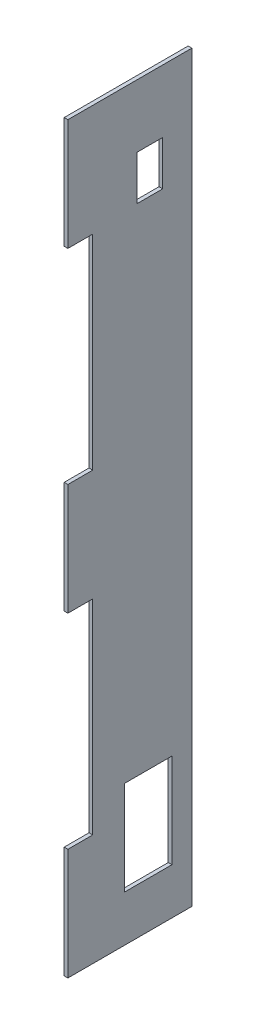
ISO-10303-21;
HEADER;
FILE_DESCRIPTION(('STEP AP214'),'2;1');
FILE_NAME('part.step','',(''),(''),'','','');
FILE_SCHEMA(('AUTOMOTIVE_DESIGN { 1 0 10303 214 1 1 1 1 }'));
ENDSEC;
DATA;
#1=APPLICATION_CONTEXT('core data for automotive mechanical design processes');
#2=APPLICATION_PROTOCOL_DEFINITION('international standard','automotive_design',2000,#1);
#3=PRODUCT_CONTEXT('',#1,'mechanical');
#4=PRODUCT('Part','Part','',(#3));
#5=PRODUCT_RELATED_PRODUCT_CATEGORY('part','',(#4));
#6=PRODUCT_DEFINITION_FORMATION('','',#4);
#7=PRODUCT_DEFINITION_CONTEXT('part definition',#1,'design');
#8=PRODUCT_DEFINITION('design','',#6,#7);
#9=PRODUCT_DEFINITION_SHAPE('','',#8);
#10=(LENGTH_UNIT() NAMED_UNIT(*) SI_UNIT(.MILLI.,.METRE.));
#11=(NAMED_UNIT(*) PLANE_ANGLE_UNIT() SI_UNIT($,.RADIAN.));
#12=(NAMED_UNIT(*) SI_UNIT($,.STERADIAN.) SOLID_ANGLE_UNIT());
#13=UNCERTAINTY_MEASURE_WITH_UNIT(LENGTH_MEASURE(1.E-05),#10,'distance_accuracy_value','');
#14=(GEOMETRIC_REPRESENTATION_CONTEXT(3) GLOBAL_UNCERTAINTY_ASSIGNED_CONTEXT((#13)) GLOBAL_UNIT_ASSIGNED_CONTEXT((#10,
#11,#12)) REPRESENTATION_CONTEXT('',''));
#15=CARTESIAN_POINT('',(0.,0.,0.));
#16=DIRECTION('',(0.,0.,1.));
#17=DIRECTION('',(1.,0.,0.));
#18=AXIS2_PLACEMENT_3D('',#15,#16,#17);
#19=CARTESIAN_POINT('',(-0.749999999999997,150.,25.));
#20=DIRECTION('',(0.,0.,-1.));
#21=DIRECTION('',(-1.,0.,0.));
#22=AXIS2_PLACEMENT_3D('',#19,#20,#21);
#23=PLANE('',#22);
#24=DIRECTION('',(0.,-1.,0.));
#25=VECTOR('',#24,1.);
#26=CARTESIAN_POINT('',(0.750000000000002,150.,25.));
#27=LINE('',#26,#25);
#28=CARTESIAN_POINT('',(0.750000000000008,-105.,25.));
#29=VERTEX_POINT('',#28);
#30=CARTESIAN_POINT('',(0.750000000000002,-150.,25.));
#31=VERTEX_POINT('',#30);
#32=EDGE_CURVE('E300',#29,#31,#27,.T.);
#33=ORIENTED_EDGE('',*,*,#32,.F.);
#34=DIRECTION('',(-1.,0.,0.));
#35=VECTOR('',#34,1.);
#36=CARTESIAN_POINT('',(0.750000000000008,-105.,25.));
#37=LINE('',#36,#35);
#38=CARTESIAN_POINT('',(-0.749999999999997,-105.,25.));
#39=VERTEX_POINT('',#38);
#40=EDGE_CURVE('E248',#29,#39,#37,.T.);
#41=ORIENTED_EDGE('',*,*,#40,.T.);
#42=DIRECTION('',(0.,-1.,0.));
#43=VECTOR('',#42,1.);
#44=CARTESIAN_POINT('',(-0.749999999999997,150.,25.));
#45=LINE('',#44,#43);
#46=CARTESIAN_POINT('',(-0.749999999999997,-150.,25.));
#47=VERTEX_POINT('',#46);
#48=EDGE_CURVE('E313',#39,#47,#45,.T.);
#49=ORIENTED_EDGE('',*,*,#48,.T.);
#50=DIRECTION('',(1.,0.,0.));
#51=VECTOR('',#50,1.);
#52=CARTESIAN_POINT('',(-0.749999999999997,-150.,25.));
#53=LINE('',#52,#51);
#54=EDGE_CURVE('E294',#47,#31,#53,.T.);
#55=ORIENTED_EDGE('',*,*,#54,.T.);
#56=EDGE_LOOP('',(#33,#41,#49,#55));
#57=FACE_BOUND('',#56,.T.);
#58=ADVANCED_FACE('F33',(#57),#23,.F.);
#59=CARTESIAN_POINT('',(-0.749999999999997,22.5,25.));
#60=VERTEX_POINT('',#59);
#61=CARTESIAN_POINT('',(-0.749999999999997,-22.5,25.));
#62=VERTEX_POINT('',#61);
#63=EDGE_CURVE('E317',#60,#62,#45,.T.);
#64=ORIENTED_EDGE('',*,*,#63,.T.);
#65=DIRECTION('',(-1.,0.,0.));
#66=VECTOR('',#65,1.);
#67=CARTESIAN_POINT('',(0.750000000000008,-22.5,25.));
#68=LINE('',#67,#66);
#69=CARTESIAN_POINT('',(0.750000000000008,-22.5,25.));
#70=VERTEX_POINT('',#69);
#71=EDGE_CURVE('E260',#70,#62,#68,.T.);
#72=ORIENTED_EDGE('',*,*,#71,.F.);
#73=CARTESIAN_POINT('',(0.750000000000008,22.5,25.));
#74=VERTEX_POINT('',#73);
#75=EDGE_CURVE('E314',#74,#70,#27,.T.);
#76=ORIENTED_EDGE('',*,*,#75,.F.);
#77=DIRECTION('',(-1.,0.,0.));
#78=VECTOR('',#77,1.);
#79=CARTESIAN_POINT('',(0.750000000000008,22.5,25.));
#80=LINE('',#79,#78);
#81=EDGE_CURVE('E281',#74,#60,#80,.T.);
#82=ORIENTED_EDGE('',*,*,#81,.T.);
#83=EDGE_LOOP('',(#64,#72,#76,#82));
#84=FACE_BOUND('',#83,.T.);
#85=ADVANCED_FACE('F338',(#84),#23,.F.);
#86=CARTESIAN_POINT('',(0.749999999999997,150.,-25.));
#87=DIRECTION('',(-1.,0.,0.));
#88=DIRECTION('',(0.,0.,1.));
#89=AXIS2_PLACEMENT_3D('',#86,#87,#88);
#90=PLANE('',#89);
#91=DIRECTION('',(0.,0.,1.));
#92=VECTOR('',#91,1.);
#93=CARTESIAN_POINT('',(0.750000000000013,106.69754913539,-2.95750469297218));
#94=LINE('',#93,#92);
#95=CARTESIAN_POINT('',(0.750000000000012,106.69754913539,-13.2546804677958));
#96=VERTEX_POINT('',#95);
#97=CARTESIAN_POINT('',(0.750000000000013,106.69754913539,-2.95750469297218));
#98=VERTEX_POINT('',#97);
#99=EDGE_CURVE('E178',#96,#98,#94,.T.);
#100=ORIENTED_EDGE('',*,*,#99,.T.);
#101=DIRECTION('',(0.,1.,0.));
#102=VECTOR('',#101,1.);
#103=CARTESIAN_POINT('',(0.750000000000013,124.655892172825,-2.95750469297218));
#104=LINE('',#103,#102);
#105=CARTESIAN_POINT('',(0.750000000000013,124.655892172825,-2.95750469297218));
#106=VERTEX_POINT('',#105);
#107=EDGE_CURVE('E172',#98,#106,#104,.T.);
#108=ORIENTED_EDGE('',*,*,#107,.T.);
#109=DIRECTION('',(0.,0.,-1.));
#110=VECTOR('',#109,1.);
#111=CARTESIAN_POINT('',(0.750000000000013,124.655892172825,-2.95750469297218));
#112=LINE('',#111,#110);
#113=CARTESIAN_POINT('',(0.749999999999998,124.655892172825,-13.2546804677958));
#114=VERTEX_POINT('',#113);
#115=EDGE_CURVE('E181',#106,#114,#112,.T.);
#116=ORIENTED_EDGE('',*,*,#115,.T.);
#117=DIRECTION('',(0.,-1.,0.));
#118=VECTOR('',#117,1.);
#119=CARTESIAN_POINT('',(0.750000000000012,124.655892172825,-13.2546804677958));
#120=LINE('',#119,#118);
#121=EDGE_CURVE('E48',#114,#96,#120,.T.);
#122=ORIENTED_EDGE('',*,*,#121,.T.);
#123=EDGE_LOOP('',(#100,#108,#116,#122));
#124=FACE_BOUND('',#123,.T.);
#125=DIRECTION('',(0.,0.,1.));
#126=VECTOR('',#125,1.);
#127=CARTESIAN_POINT('',(0.75000000000001,-131.388520939595,2.12848720912007));
#128=LINE('',#127,#126);
#129=CARTESIAN_POINT('',(0.750000000000008,-131.388520939595,-16.9890980465084));
#130=VERTEX_POINT('',#129);
#131=CARTESIAN_POINT('',(0.75000000000001,-131.388520939595,2.12848720912007));
#132=VERTEX_POINT('',#131);
#133=EDGE_CURVE('E216',#130,#132,#128,.T.);
#134=ORIENTED_EDGE('',*,*,#133,.T.);
#135=DIRECTION('',(0.,1.,0.));
#136=VECTOR('',#135,1.);
#137=CARTESIAN_POINT('',(0.75000000000001,-93.4149518013214,2.12848720912007));
#138=LINE('',#137,#136);
#139=CARTESIAN_POINT('',(0.75000000000001,-93.4149518013214,2.12848720912007));
#140=VERTEX_POINT('',#139);
#141=EDGE_CURVE('E206',#132,#140,#138,.T.);
#142=ORIENTED_EDGE('',*,*,#141,.T.);
#143=DIRECTION('',(0.,0.,-1.));
#144=VECTOR('',#143,1.);
#145=CARTESIAN_POINT('',(0.75000000000001,-93.4149518013214,2.12848720912007));
#146=LINE('',#145,#144);
#147=CARTESIAN_POINT('',(0.749999999999998,-93.4149518013214,-16.9890980465084));
#148=VERTEX_POINT('',#147);
#149=EDGE_CURVE('E209',#140,#148,#146,.T.);
#150=ORIENTED_EDGE('',*,*,#149,.T.);
#151=DIRECTION('',(0.,-1.,0.));
#152=VECTOR('',#151,1.);
#153=CARTESIAN_POINT('',(0.750000000000008,-93.4149518013214,-16.9890980465084));
#154=LINE('',#153,#152);
#155=EDGE_CURVE('E213',#148,#130,#154,.T.);
#156=ORIENTED_EDGE('',*,*,#155,.T.);
#157=EDGE_LOOP('',(#134,#142,#150,#156));
#158=FACE_BOUND('',#157,.T.);
#159=DIRECTION('',(0.,-1.,0.));
#160=VECTOR('',#159,1.);
#161=CARTESIAN_POINT('',(0.750000000000007,-105.,15.));
#162=LINE('',#161,#160);
#163=CARTESIAN_POINT('',(0.750000000000007,-22.5,15.));
#164=VERTEX_POINT('',#163);
#165=CARTESIAN_POINT('',(0.750000000000007,-105.,15.));
#166=VERTEX_POINT('',#165);
#167=EDGE_CURVE('E245',#164,#166,#162,.T.);
#168=ORIENTED_EDGE('',*,*,#167,.T.);
#169=DIRECTION('',(0.,0.,1.));
#170=VECTOR('',#169,1.);
#171=CARTESIAN_POINT('',(0.750000000000008,-105.,25.));
#172=LINE('',#171,#170);
#173=EDGE_CURVE('E238',#166,#29,#172,.T.);
#174=ORIENTED_EDGE('',*,*,#173,.T.);
#175=ORIENTED_EDGE('',*,*,#32,.T.);
#176=DIRECTION('',(0.,0.,-1.));
#177=VECTOR('',#176,1.);
#178=CARTESIAN_POINT('',(0.749999999999997,-150.,-25.));
#179=LINE('',#178,#177);
#180=CARTESIAN_POINT('',(0.749999999999997,-150.,-25.));
#181=VERTEX_POINT('',#180);
#182=EDGE_CURVE('E284',#31,#181,#179,.T.);
#183=ORIENTED_EDGE('',*,*,#182,.T.);
#184=DIRECTION('',(0.,-1.,0.));
#185=VECTOR('',#184,1.);
#186=CARTESIAN_POINT('',(0.749999999999997,150.,-25.));
#187=LINE('',#186,#185);
#188=CARTESIAN_POINT('',(0.749999999999997,150.,-25.));
#189=VERTEX_POINT('',#188);
#190=EDGE_CURVE('E11',#189,#181,#187,.T.);
#191=ORIENTED_EDGE('',*,*,#190,.F.);
#192=DIRECTION('',(0.,0.,-1.));
#193=VECTOR('',#192,1.);
#194=CARTESIAN_POINT('',(0.749999999999997,150.,-25.));
#195=LINE('',#194,#193);
#196=CARTESIAN_POINT('',(0.750000000000002,150.,25.));
#197=VERTEX_POINT('',#196);
#198=EDGE_CURVE('E290',#197,#189,#195,.T.);
#199=ORIENTED_EDGE('',*,*,#198,.F.);
#200=CARTESIAN_POINT('',(0.750000000000002,105.,25.));
#201=VERTEX_POINT('',#200);
#202=EDGE_CURVE('E310',#197,#201,#27,.T.);
#203=ORIENTED_EDGE('',*,*,#202,.T.);
#204=DIRECTION('',(0.,0.,-1.));
#205=VECTOR('',#204,1.);
#206=CARTESIAN_POINT('',(0.750000000000008,105.,25.));
#207=LINE('',#206,#205);
#208=CARTESIAN_POINT('',(0.750000000000007,105.,15.));
#209=VERTEX_POINT('',#208);
#210=EDGE_CURVE('E264',#201,#209,#207,.T.);
#211=ORIENTED_EDGE('',*,*,#210,.T.);
#212=DIRECTION('',(0.,-1.,0.));
#213=VECTOR('',#212,1.);
#214=CARTESIAN_POINT('',(0.750000000000007,105.,15.));
#215=LINE('',#214,#213);
#216=CARTESIAN_POINT('',(0.750000000000007,22.5,15.));
#217=VERTEX_POINT('',#216);
#218=EDGE_CURVE('E267',#209,#217,#215,.T.);
#219=ORIENTED_EDGE('',*,*,#218,.T.);
#220=DIRECTION('',(0.,0.,1.));
#221=VECTOR('',#220,1.);
#222=CARTESIAN_POINT('',(0.750000000000008,22.5,25.));
#223=LINE('',#222,#221);
#224=EDGE_CURVE('E271',#217,#74,#223,.T.);
#225=ORIENTED_EDGE('',*,*,#224,.T.);
#226=ORIENTED_EDGE('',*,*,#75,.T.);
#227=DIRECTION('',(0.,0.,-1.));
#228=VECTOR('',#227,1.);
#229=CARTESIAN_POINT('',(0.750000000000008,-22.5,25.));
#230=LINE('',#229,#228);
#231=EDGE_CURVE('E241',#70,#164,#230,.T.);
#232=ORIENTED_EDGE('',*,*,#231,.T.);
#233=EDGE_LOOP('',(#168,#174,#175,#183,#191,#199,#203,#211,#219,#225,#226,#232));
#234=FACE_BOUND('',#233,.T.);
#235=ADVANCED_FACE('F35',(#124,#158,#234),#90,.F.);
#236=CARTESIAN_POINT('',(-0.750000000000002,150.,-25.));
#237=DIRECTION('',(0.,0.,1.));
#238=DIRECTION('',(1.,0.,0.));
#239=AXIS2_PLACEMENT_3D('',#236,#237,#238);
#240=PLANE('',#239);
#241=DIRECTION('',(-1.,0.,0.));
#242=VECTOR('',#241,1.);
#243=CARTESIAN_POINT('',(-0.750000000000002,-150.,-25.));
#244=LINE('',#243,#242);
#245=CARTESIAN_POINT('',(-0.750000000000002,-150.,-25.));
#246=VERTEX_POINT('',#245);
#247=EDGE_CURVE('E303',#181,#246,#244,.T.);
#248=ORIENTED_EDGE('',*,*,#247,.T.);
#249=DIRECTION('',(0.,-1.,0.));
#250=VECTOR('',#249,1.);
#251=CARTESIAN_POINT('',(-0.750000000000002,150.,-25.));
#252=LINE('',#251,#250);
#253=CARTESIAN_POINT('',(-0.750000000000002,150.,-25.));
#254=VERTEX_POINT('',#253);
#255=EDGE_CURVE('E41',#254,#246,#252,.T.);
#256=ORIENTED_EDGE('',*,*,#255,.F.);
#257=DIRECTION('',(-1.,0.,0.));
#258=VECTOR('',#257,1.);
#259=CARTESIAN_POINT('',(-0.750000000000002,150.,-25.));
#260=LINE('',#259,#258);
#261=EDGE_CURVE('E293',#189,#254,#260,.T.);
#262=ORIENTED_EDGE('',*,*,#261,.F.);
#263=ORIENTED_EDGE('',*,*,#190,.T.);
#264=EDGE_LOOP('',(#248,#256,#262,#263));
#265=FACE_BOUND('',#264,.T.);
#266=ADVANCED_FACE('F386',(#265),#240,.F.);
#267=CARTESIAN_POINT('',(-0.750000000000002,150.,-25.));
#268=DIRECTION('',(1.,0.,0.));
#269=DIRECTION('',(0.,0.,-1.));
#270=AXIS2_PLACEMENT_3D('',#267,#268,#269);
#271=PLANE('',#270);
#272=DIRECTION('',(0.,0.,-1.));
#273=VECTOR('',#272,1.);
#274=CARTESIAN_POINT('',(-0.75,124.655892172825,-2.95750469297218));
#275=LINE('',#274,#273);
#276=CARTESIAN_POINT('',(-0.75,124.655892172825,-2.95750469297218));
#277=VERTEX_POINT('',#276);
#278=CARTESIAN_POINT('',(-0.750000000000001,124.655892172825,-13.2546804677958));
#279=VERTEX_POINT('',#278);
#280=EDGE_CURVE('E196',#277,#279,#275,.T.);
#281=ORIENTED_EDGE('',*,*,#280,.F.);
#282=DIRECTION('',(0.,1.,0.));
#283=VECTOR('',#282,1.);
#284=CARTESIAN_POINT('',(-0.75,124.655892172825,-2.95750469297218));
#285=LINE('',#284,#283);
#286=CARTESIAN_POINT('',(-0.75,106.69754913539,-2.95750469297218));
#287=VERTEX_POINT('',#286);
#288=EDGE_CURVE('E56',#287,#277,#285,.T.);
#289=ORIENTED_EDGE('',*,*,#288,.F.);
#290=DIRECTION('',(0.,0.,1.));
#291=VECTOR('',#290,1.);
#292=CARTESIAN_POINT('',(-0.75,106.69754913539,-2.95750469297218));
#293=LINE('',#292,#291);
#294=CARTESIAN_POINT('',(-0.750000000000001,106.69754913539,-13.2546804677958));
#295=VERTEX_POINT('',#294);
#296=EDGE_CURVE('E187',#295,#287,#293,.T.);
#297=ORIENTED_EDGE('',*,*,#296,.F.);
#298=DIRECTION('',(0.,-1.,0.));
#299=VECTOR('',#298,1.);
#300=CARTESIAN_POINT('',(-0.750000000000001,124.655892172825,-13.2546804677958));
#301=LINE('',#300,#299);
#302=EDGE_CURVE('E190',#279,#295,#301,.T.);
#303=ORIENTED_EDGE('',*,*,#302,.F.);
#304=EDGE_LOOP('',(#281,#289,#297,#303));
#305=FACE_BOUND('',#304,.T.);
#306=DIRECTION('',(0.,0.,-1.));
#307=VECTOR('',#306,1.);
#308=CARTESIAN_POINT('',(-0.75,-93.4149518013214,2.12848720912007));
#309=LINE('',#308,#307);
#310=CARTESIAN_POINT('',(-0.75,-93.4149518013214,2.12848720912007));
#311=VERTEX_POINT('',#310);
#312=CARTESIAN_POINT('',(-0.750000000000002,-93.4149518013214,-16.9890980465084));
#313=VERTEX_POINT('',#312);
#314=EDGE_CURVE('E221',#311,#313,#309,.T.);
#315=ORIENTED_EDGE('',*,*,#314,.F.);
#316=DIRECTION('',(0.,1.,0.));
#317=VECTOR('',#316,1.);
#318=CARTESIAN_POINT('',(-0.75,-93.4149518013214,2.12848720912007));
#319=LINE('',#318,#317);
#320=CARTESIAN_POINT('',(-0.75,-131.388520939595,2.12848720912007));
#321=VERTEX_POINT('',#320);
#322=EDGE_CURVE('E202',#321,#311,#319,.T.);
#323=ORIENTED_EDGE('',*,*,#322,.F.);
#324=DIRECTION('',(0.,0.,1.));
#325=VECTOR('',#324,1.);
#326=CARTESIAN_POINT('',(-0.75,-131.388520939595,2.12848720912007));
#327=LINE('',#326,#325);
#328=CARTESIAN_POINT('',(-0.750000000000002,-131.388520939595,-16.9890980465084));
#329=VERTEX_POINT('',#328);
#330=EDGE_CURVE('E210',#329,#321,#327,.T.);
#331=ORIENTED_EDGE('',*,*,#330,.F.);
#332=DIRECTION('',(0.,-1.,0.));
#333=VECTOR('',#332,1.);
#334=CARTESIAN_POINT('',(-0.750000000000002,-93.4149518013214,-16.9890980465084));
#335=LINE('',#334,#333);
#336=EDGE_CURVE('E224',#313,#329,#335,.T.);
#337=ORIENTED_EDGE('',*,*,#336,.F.);
#338=EDGE_LOOP('',(#315,#323,#331,#337));
#339=FACE_BOUND('',#338,.T.);
#340=ORIENTED_EDGE('',*,*,#48,.F.);
#341=DIRECTION('',(0.,0.,1.));
#342=VECTOR('',#341,1.);
#343=CARTESIAN_POINT('',(-0.749999999999997,-105.,25.));
#344=LINE('',#343,#342);
#345=CARTESIAN_POINT('',(-0.749999999999998,-105.,15.));
#346=VERTEX_POINT('',#345);
#347=EDGE_CURVE('E231',#346,#39,#344,.T.);
#348=ORIENTED_EDGE('',*,*,#347,.F.);
#349=DIRECTION('',(0.,-1.,0.));
#350=VECTOR('',#349,1.);
#351=CARTESIAN_POINT('',(-0.749999999999998,-105.,15.));
#352=LINE('',#351,#350);
#353=CARTESIAN_POINT('',(-0.749999999999998,-22.5,15.));
#354=VERTEX_POINT('',#353);
#355=EDGE_CURVE('E242',#354,#346,#352,.T.);
#356=ORIENTED_EDGE('',*,*,#355,.F.);
#357=DIRECTION('',(0.,0.,-1.));
#358=VECTOR('',#357,1.);
#359=CARTESIAN_POINT('',(-0.749999999999997,-22.5,25.));
#360=LINE('',#359,#358);
#361=EDGE_CURVE('E250',#62,#354,#360,.T.);
#362=ORIENTED_EDGE('',*,*,#361,.F.);
#363=ORIENTED_EDGE('',*,*,#63,.F.);
#364=DIRECTION('',(0.,0.,1.));
#365=VECTOR('',#364,1.);
#366=CARTESIAN_POINT('',(-0.749999999999997,22.5,25.));
#367=LINE('',#366,#365);
#368=CARTESIAN_POINT('',(-0.749999999999998,22.5,15.));
#369=VERTEX_POINT('',#368);
#370=EDGE_CURVE('E268',#369,#60,#367,.T.);
#371=ORIENTED_EDGE('',*,*,#370,.F.);
#372=DIRECTION('',(0.,-1.,0.));
#373=VECTOR('',#372,1.);
#374=CARTESIAN_POINT('',(-0.749999999999998,105.,15.));
#375=LINE('',#374,#373);
#376=CARTESIAN_POINT('',(-0.749999999999998,105.,15.));
#377=VERTEX_POINT('',#376);
#378=EDGE_CURVE('E277',#377,#369,#375,.T.);
#379=ORIENTED_EDGE('',*,*,#378,.F.);
#380=DIRECTION('',(0.,0.,-1.));
#381=VECTOR('',#380,1.);
#382=CARTESIAN_POINT('',(-0.749999999999997,105.,25.));
#383=LINE('',#382,#381);
#384=CARTESIAN_POINT('',(-0.749999999999997,105.,25.));
#385=VERTEX_POINT('',#384);
#386=EDGE_CURVE('E257',#385,#377,#383,.T.);
#387=ORIENTED_EDGE('',*,*,#386,.F.);
#388=CARTESIAN_POINT('',(-0.749999999999997,150.,25.));
#389=VERTEX_POINT('',#388);
#390=EDGE_CURVE('E315',#389,#385,#45,.T.);
#391=ORIENTED_EDGE('',*,*,#390,.F.);
#392=DIRECTION('',(0.,0.,1.));
#393=VECTOR('',#392,1.);
#394=CARTESIAN_POINT('',(-0.750000000000002,150.,-25.));
#395=LINE('',#394,#393);
#396=EDGE_CURVE('E296',#254,#389,#395,.T.);
#397=ORIENTED_EDGE('',*,*,#396,.F.);
#398=ORIENTED_EDGE('',*,*,#255,.T.);
#399=DIRECTION('',(0.,0.,1.));
#400=VECTOR('',#399,1.);
#401=CARTESIAN_POINT('',(-0.750000000000002,-150.,-25.));
#402=LINE('',#401,#400);
#403=EDGE_CURVE('E305',#246,#47,#402,.T.);
#404=ORIENTED_EDGE('',*,*,#403,.T.);
#405=EDGE_LOOP('',(#340,#348,#356,#362,#363,#371,#379,#387,#391,#397,#398,#404));
#406=FACE_BOUND('',#405,.T.);
#407=ADVANCED_FACE('F324',(#305,#339,#406),#271,.F.);
#408=ORIENTED_EDGE('',*,*,#390,.T.);
#409=DIRECTION('',(-1.,0.,0.));
#410=VECTOR('',#409,1.);
#411=CARTESIAN_POINT('',(0.750000000000008,105.,25.));
#412=LINE('',#411,#410);
#413=EDGE_CURVE('E274',#201,#385,#412,.T.);
#414=ORIENTED_EDGE('',*,*,#413,.F.);
#415=ORIENTED_EDGE('',*,*,#202,.F.);
#416=DIRECTION('',(1.,0.,0.));
#417=VECTOR('',#416,1.);
#418=CARTESIAN_POINT('',(-0.749999999999997,150.,25.));
#419=LINE('',#418,#417);
#420=EDGE_CURVE('E298',#389,#197,#419,.T.);
#421=ORIENTED_EDGE('',*,*,#420,.F.);
#422=EDGE_LOOP('',(#408,#414,#415,#421));
#423=FACE_BOUND('',#422,.T.);
#424=ADVANCED_FACE('F369',(#423),#23,.F.);
#425=CARTESIAN_POINT('',(0.,150.,0.));
#426=DIRECTION('',(0.,1.,0.));
#427=DIRECTION('',(0.,0.,1.));
#428=AXIS2_PLACEMENT_3D('',#425,#426,#427);
#429=PLANE('',#428);
#430=ORIENTED_EDGE('',*,*,#198,.T.);
#431=ORIENTED_EDGE('',*,*,#261,.T.);
#432=ORIENTED_EDGE('',*,*,#396,.T.);
#433=ORIENTED_EDGE('',*,*,#420,.T.);
#434=EDGE_LOOP('',(#430,#431,#432,#433));
#435=FACE_BOUND('',#434,.T.);
#436=ADVANCED_FACE('F377',(#435),#429,.T.);
#437=CARTESIAN_POINT('',(0.,-150.,0.));
#438=DIRECTION('',(0.,1.,0.));
#439=DIRECTION('',(0.,0.,1.));
#440=AXIS2_PLACEMENT_3D('',#437,#438,#439);
#441=PLANE('',#440);
#442=ORIENTED_EDGE('',*,*,#182,.F.);
#443=ORIENTED_EDGE('',*,*,#54,.F.);
#444=ORIENTED_EDGE('',*,*,#403,.F.);
#445=ORIENTED_EDGE('',*,*,#247,.F.);
#446=EDGE_LOOP('',(#442,#443,#444,#445));
#447=FACE_BOUND('',#446,.T.);
#448=ADVANCED_FACE('F330',(#447),#441,.F.);
#449=CARTESIAN_POINT('',(0.750000000000008,22.5,25.));
#450=DIRECTION('',(0.,-1.,0.));
#451=DIRECTION('',(0.,0.,-1.));
#452=AXIS2_PLACEMENT_3D('',#449,#450,#451);
#453=PLANE('',#452);
#454=ORIENTED_EDGE('',*,*,#370,.T.);
#455=ORIENTED_EDGE('',*,*,#81,.F.);
#456=ORIENTED_EDGE('',*,*,#224,.F.);
#457=DIRECTION('',(-1.,0.,0.));
#458=VECTOR('',#457,1.);
#459=CARTESIAN_POINT('',(0.750000000000007,22.5,15.));
#460=LINE('',#459,#458);
#461=EDGE_CURVE('E285',#217,#369,#460,.T.);
#462=ORIENTED_EDGE('',*,*,#461,.T.);
#463=EDGE_LOOP('',(#454,#455,#456,#462));
#464=FACE_BOUND('',#463,.T.);
#465=ADVANCED_FACE('F518',(#464),#453,.F.);
#466=CARTESIAN_POINT('',(0.750000000000007,105.,15.));
#467=DIRECTION('',(0.,0.,-1.));
#468=DIRECTION('',(0.,1.,0.));
#469=AXIS2_PLACEMENT_3D('',#466,#467,#468);
#470=PLANE('',#469);
#471=ORIENTED_EDGE('',*,*,#378,.T.);
#472=ORIENTED_EDGE('',*,*,#461,.F.);
#473=ORIENTED_EDGE('',*,*,#218,.F.);
#474=DIRECTION('',(-1.,0.,0.));
#475=VECTOR('',#474,1.);
#476=CARTESIAN_POINT('',(0.750000000000007,105.,15.));
#477=LINE('',#476,#475);
#478=EDGE_CURVE('E287',#209,#377,#477,.T.);
#479=ORIENTED_EDGE('',*,*,#478,.T.);
#480=EDGE_LOOP('',(#471,#472,#473,#479));
#481=FACE_BOUND('',#480,.T.);
#482=ADVANCED_FACE('F510',(#481),#470,.F.);
#483=CARTESIAN_POINT('',(0.750000000000008,105.,25.));
#484=DIRECTION('',(0.,1.,0.));
#485=DIRECTION('',(0.,0.,1.));
#486=AXIS2_PLACEMENT_3D('',#483,#484,#485);
#487=PLANE('',#486);
#488=ORIENTED_EDGE('',*,*,#386,.T.);
#489=ORIENTED_EDGE('',*,*,#478,.F.);
#490=ORIENTED_EDGE('',*,*,#210,.F.);
#491=ORIENTED_EDGE('',*,*,#413,.T.);
#492=EDGE_LOOP('',(#488,#489,#490,#491));
#493=FACE_BOUND('',#492,.T.);
#494=ADVANCED_FACE('F364',(#493),#487,.F.);
#495=CARTESIAN_POINT('',(0.750000000000008,-105.,25.));
#496=DIRECTION('',(0.,-1.,0.));
#497=DIRECTION('',(0.,0.,-1.));
#498=AXIS2_PLACEMENT_3D('',#495,#496,#497);
#499=PLANE('',#498);
#500=ORIENTED_EDGE('',*,*,#347,.T.);
#501=ORIENTED_EDGE('',*,*,#40,.F.);
#502=ORIENTED_EDGE('',*,*,#173,.F.);
#503=DIRECTION('',(-1.,0.,0.));
#504=VECTOR('',#503,1.);
#505=CARTESIAN_POINT('',(0.750000000000007,-105.,15.));
#506=LINE('',#505,#504);
#507=EDGE_CURVE('E255',#166,#346,#506,.T.);
#508=ORIENTED_EDGE('',*,*,#507,.T.);
#509=EDGE_LOOP('',(#500,#501,#502,#508));
#510=FACE_BOUND('',#509,.T.);
#511=ADVANCED_FACE('F353',(#510),#499,.F.);
#512=CARTESIAN_POINT('',(0.750000000000007,-105.,15.));
#513=DIRECTION('',(0.,0.,-1.));
#514=DIRECTION('',(0.,1.,0.));
#515=AXIS2_PLACEMENT_3D('',#512,#513,#514);
#516=PLANE('',#515);
#517=ORIENTED_EDGE('',*,*,#355,.T.);
#518=ORIENTED_EDGE('',*,*,#507,.F.);
#519=ORIENTED_EDGE('',*,*,#167,.F.);
#520=DIRECTION('',(-1.,0.,0.));
#521=VECTOR('',#520,1.);
#522=CARTESIAN_POINT('',(0.750000000000007,-22.5,15.));
#523=LINE('',#522,#521);
#524=EDGE_CURVE('E258',#164,#354,#523,.T.);
#525=ORIENTED_EDGE('',*,*,#524,.T.);
#526=EDGE_LOOP('',(#517,#518,#519,#525));
#527=FACE_BOUND('',#526,.T.);
#528=ADVANCED_FACE('F355',(#527),#516,.F.);
#529=CARTESIAN_POINT('',(0.750000000000008,-22.5,25.));
#530=DIRECTION('',(0.,1.,0.));
#531=DIRECTION('',(0.,0.,1.));
#532=AXIS2_PLACEMENT_3D('',#529,#530,#531);
#533=PLANE('',#532);
#534=ORIENTED_EDGE('',*,*,#361,.T.);
#535=ORIENTED_EDGE('',*,*,#524,.F.);
#536=ORIENTED_EDGE('',*,*,#231,.F.);
#537=ORIENTED_EDGE('',*,*,#71,.T.);
#538=EDGE_LOOP('',(#534,#535,#536,#537));
#539=FACE_BOUND('',#538,.T.);
#540=ADVANCED_FACE('F346',(#539),#533,.F.);
#541=CARTESIAN_POINT('',(0.75000000000001,-93.4149518013214,2.12848720912007));
#542=DIRECTION('',(0.,0.,1.));
#543=DIRECTION('',(1.,0.,0.));
#544=AXIS2_PLACEMENT_3D('',#541,#542,#543);
#545=PLANE('',#544);
#546=ORIENTED_EDGE('',*,*,#322,.T.);
#547=DIRECTION('',(-1.,0.,0.));
#548=VECTOR('',#547,1.);
#549=CARTESIAN_POINT('',(0.75000000000001,-93.4149518013214,2.12848720912007));
#550=LINE('',#549,#548);
#551=EDGE_CURVE('E219',#140,#311,#550,.T.);
#552=ORIENTED_EDGE('',*,*,#551,.F.);
#553=ORIENTED_EDGE('',*,*,#141,.F.);
#554=DIRECTION('',(-1.,0.,0.));
#555=VECTOR('',#554,1.);
#556=CARTESIAN_POINT('',(0.75000000000001,-131.388520939595,2.12848720912007));
#557=LINE('',#556,#555);
#558=EDGE_CURVE('E229',#132,#321,#557,.T.);
#559=ORIENTED_EDGE('',*,*,#558,.T.);
#560=EDGE_LOOP('',(#546,#552,#553,#559));
#561=FACE_BOUND('',#560,.T.);
#562=ADVANCED_FACE('F362',(#561),#545,.F.);
#563=CARTESIAN_POINT('',(0.75000000000001,-131.388520939595,2.12848720912007));
#564=DIRECTION('',(0.,-1.,0.));
#565=DIRECTION('',(0.,0.,-1.));
#566=AXIS2_PLACEMENT_3D('',#563,#564,#565);
#567=PLANE('',#566);
#568=ORIENTED_EDGE('',*,*,#330,.T.);
#569=ORIENTED_EDGE('',*,*,#558,.F.);
#570=ORIENTED_EDGE('',*,*,#133,.F.);
#571=DIRECTION('',(-1.,0.,0.));
#572=VECTOR('',#571,1.);
#573=CARTESIAN_POINT('',(0.750000000000008,-131.388520939595,-16.9890980465084));
#574=LINE('',#573,#572);
#575=EDGE_CURVE('E232',#130,#329,#574,.T.);
#576=ORIENTED_EDGE('',*,*,#575,.T.);
#577=EDGE_LOOP('',(#568,#569,#570,#576));
#578=FACE_BOUND('',#577,.T.);
#579=ADVANCED_FACE('F449',(#578),#567,.F.);
#580=CARTESIAN_POINT('',(0.750000000000008,-93.4149518013214,-16.9890980465084));
#581=DIRECTION('',(0.,0.,-1.));
#582=DIRECTION('',(-1.,0.,0.));
#583=AXIS2_PLACEMENT_3D('',#580,#581,#582);
#584=PLANE('',#583);
#585=ORIENTED_EDGE('',*,*,#336,.T.);
#586=ORIENTED_EDGE('',*,*,#575,.F.);
#587=ORIENTED_EDGE('',*,*,#155,.F.);
#588=DIRECTION('',(-1.,0.,0.));
#589=VECTOR('',#588,1.);
#590=CARTESIAN_POINT('',(0.750000000000008,-93.4149518013214,-16.9890980465084));
#591=LINE('',#590,#589);
#592=EDGE_CURVE('E234',#148,#313,#591,.T.);
#593=ORIENTED_EDGE('',*,*,#592,.T.);
#594=EDGE_LOOP('',(#585,#586,#587,#593));
#595=FACE_BOUND('',#594,.T.);
#596=ADVANCED_FACE('F452',(#595),#584,.F.);
#597=CARTESIAN_POINT('',(0.75000000000001,-93.4149518013214,2.12848720912007));
#598=DIRECTION('',(0.,1.,0.));
#599=DIRECTION('',(0.,0.,1.));
#600=AXIS2_PLACEMENT_3D('',#597,#598,#599);
#601=PLANE('',#600);
#602=ORIENTED_EDGE('',*,*,#314,.T.);
#603=ORIENTED_EDGE('',*,*,#592,.F.);
#604=ORIENTED_EDGE('',*,*,#149,.F.);
#605=ORIENTED_EDGE('',*,*,#551,.T.);
#606=EDGE_LOOP('',(#602,#603,#604,#605));
#607=FACE_BOUND('',#606,.T.);
#608=ADVANCED_FACE('F405',(#607),#601,.F.);
#609=CARTESIAN_POINT('',(0.750000000000013,124.655892172825,-2.95750469297218));
#610=DIRECTION('',(0.,0.,1.));
#611=DIRECTION('',(1.,0.,0.));
#612=AXIS2_PLACEMENT_3D('',#609,#610,#611);
#613=PLANE('',#612);
#614=ORIENTED_EDGE('',*,*,#288,.T.);
#615=DIRECTION('',(-1.,0.,0.));
#616=VECTOR('',#615,1.);
#617=CARTESIAN_POINT('',(0.750000000000013,124.655892172825,-2.95750469297218));
#618=LINE('',#617,#616);
#619=EDGE_CURVE('E168',#106,#277,#618,.T.);
#620=ORIENTED_EDGE('',*,*,#619,.F.);
#621=ORIENTED_EDGE('',*,*,#107,.F.);
#622=DIRECTION('',(-1.,0.,0.));
#623=VECTOR('',#622,1.);
#624=CARTESIAN_POINT('',(0.750000000000013,106.69754913539,-2.95750469297218));
#625=LINE('',#624,#623);
#626=EDGE_CURVE('E200',#98,#287,#625,.T.);
#627=ORIENTED_EDGE('',*,*,#626,.T.);
#628=EDGE_LOOP('',(#614,#620,#621,#627));
#629=FACE_BOUND('',#628,.T.);
#630=ADVANCED_FACE('F170',(#629),#613,.F.);
#631=CARTESIAN_POINT('',(0.750000000000013,106.69754913539,-2.95750469297218));
#632=DIRECTION('',(0.,-1.,0.));
#633=DIRECTION('',(0.,0.,-1.));
#634=AXIS2_PLACEMENT_3D('',#631,#632,#633);
#635=PLANE('',#634);
#636=ORIENTED_EDGE('',*,*,#296,.T.);
#637=ORIENTED_EDGE('',*,*,#626,.F.);
#638=ORIENTED_EDGE('',*,*,#99,.F.);
#639=DIRECTION('',(-1.,0.,0.));
#640=VECTOR('',#639,1.);
#641=CARTESIAN_POINT('',(0.750000000000012,106.69754913539,-13.2546804677958));
#642=LINE('',#641,#640);
#643=EDGE_CURVE('E203',#96,#295,#642,.T.);
#644=ORIENTED_EDGE('',*,*,#643,.T.);
#645=EDGE_LOOP('',(#636,#637,#638,#644));
#646=FACE_BOUND('',#645,.T.);
#647=ADVANCED_FACE('F418',(#646),#635,.F.);
#648=CARTESIAN_POINT('',(0.750000000000012,124.655892172825,-13.2546804677958));
#649=DIRECTION('',(0.,0.,-1.));
#650=DIRECTION('',(-1.,0.,0.));
#651=AXIS2_PLACEMENT_3D('',#648,#649,#650);
#652=PLANE('',#651);
#653=ORIENTED_EDGE('',*,*,#302,.T.);
#654=ORIENTED_EDGE('',*,*,#643,.F.);
#655=ORIENTED_EDGE('',*,*,#121,.F.);
#656=DIRECTION('',(-1.,0.,0.));
#657=VECTOR('',#656,1.);
#658=CARTESIAN_POINT('',(0.750000000000012,124.655892172825,-13.2546804677958));
#659=LINE('',#658,#657);
#660=EDGE_CURVE('E177',#114,#279,#659,.T.);
#661=ORIENTED_EDGE('',*,*,#660,.T.);
#662=EDGE_LOOP('',(#653,#654,#655,#661));
#663=FACE_BOUND('',#662,.T.);
#664=ADVANCED_FACE('F427',(#663),#652,.F.);
#665=CARTESIAN_POINT('',(0.750000000000013,124.655892172825,-2.95750469297218));
#666=DIRECTION('',(0.,1.,0.));
#667=DIRECTION('',(0.,0.,1.));
#668=AXIS2_PLACEMENT_3D('',#665,#666,#667);
#669=PLANE('',#668);
#670=ORIENTED_EDGE('',*,*,#280,.T.);
#671=ORIENTED_EDGE('',*,*,#660,.F.);
#672=ORIENTED_EDGE('',*,*,#115,.F.);
#673=ORIENTED_EDGE('',*,*,#619,.T.);
#674=EDGE_LOOP('',(#670,#671,#672,#673));
#675=FACE_BOUND('',#674,.T.);
#676=ADVANCED_FACE('F182',(#675),#669,.F.);
#677=CLOSED_SHELL('',(#58,#85,#235,#266,#407,#424,#436,#448,#465,#482,#494,#511,#528,#540,#562,
#579,#596,#608,#630,#647,#664,#676));
#678=MANIFOLD_SOLID_BREP('B2',#677);
#679=ADVANCED_BREP_SHAPE_REPRESENTATION('',(#18,#678),#14);
#680=SHAPE_DEFINITION_REPRESENTATION(#9,#679);
ENDSEC;
END-ISO-10303-21;
